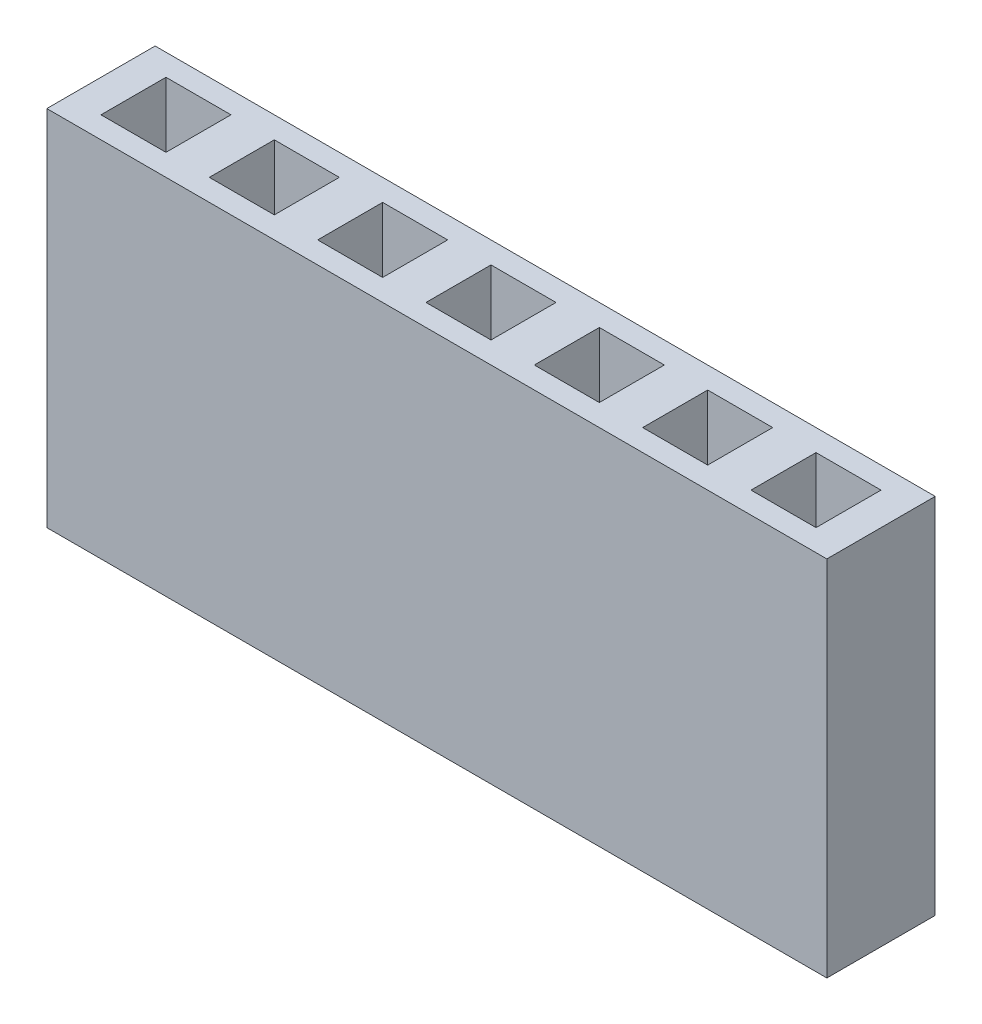
ISO-10303-21;
HEADER;
FILE_DESCRIPTION(('STEP AP214'),'2;1');
FILE_NAME('part.step','',(''),(''),'','','');
FILE_SCHEMA(('AUTOMOTIVE_DESIGN { 1 0 10303 214 1 1 1 1 }'));
ENDSEC;
DATA;
#1=APPLICATION_CONTEXT('core data for automotive mechanical design processes');
#2=APPLICATION_PROTOCOL_DEFINITION('international standard','automotive_design',2000,#1);
#3=PRODUCT_CONTEXT('',#1,'mechanical');
#4=PRODUCT('Part','Part','',(#3));
#5=PRODUCT_RELATED_PRODUCT_CATEGORY('part','',(#4));
#6=PRODUCT_DEFINITION_FORMATION('','',#4);
#7=PRODUCT_DEFINITION_CONTEXT('part definition',#1,'design');
#8=PRODUCT_DEFINITION('design','',#6,#7);
#9=PRODUCT_DEFINITION_SHAPE('','',#8);
#10=(LENGTH_UNIT() NAMED_UNIT(*) SI_UNIT(.MILLI.,.METRE.));
#11=(NAMED_UNIT(*) PLANE_ANGLE_UNIT() SI_UNIT($,.RADIAN.));
#12=(NAMED_UNIT(*) SI_UNIT($,.STERADIAN.) SOLID_ANGLE_UNIT());
#13=UNCERTAINTY_MEASURE_WITH_UNIT(LENGTH_MEASURE(1.E-05),#10,'distance_accuracy_value','');
#14=(GEOMETRIC_REPRESENTATION_CONTEXT(3) GLOBAL_UNCERTAINTY_ASSIGNED_CONTEXT((#13)) GLOBAL_UNIT_ASSIGNED_CONTEXT((#10,
#11,#12)) REPRESENTATION_CONTEXT('',''));
#15=CARTESIAN_POINT('',(0.,0.,0.));
#16=DIRECTION('',(0.,0.,1.));
#17=DIRECTION('',(1.,0.,0.));
#18=AXIS2_PLACEMENT_3D('',#15,#16,#17);
#19=CARTESIAN_POINT('',(-9.144,8.509,1.27));
#20=DIRECTION('',(1.,0.,0.));
#21=DIRECTION('',(0.,0.,-1.));
#22=AXIS2_PLACEMENT_3D('',#19,#20,#21);
#23=PLANE('',#22);
#24=DIRECTION('',(0.,0.,1.));
#25=VECTOR('',#24,1.);
#26=CARTESIAN_POINT('',(-9.144,0.,1.27));
#27=LINE('',#26,#25);
#28=CARTESIAN_POINT('',(-9.144,0.,-1.27));
#29=VERTEX_POINT('',#28);
#30=CARTESIAN_POINT('',(-9.144,0.,1.27));
#31=VERTEX_POINT('',#30);
#32=EDGE_CURVE('E466',#29,#31,#27,.T.);
#33=ORIENTED_EDGE('',*,*,#32,.T.);
#34=DIRECTION('',(0.,-1.,0.));
#35=VECTOR('',#34,1.);
#36=CARTESIAN_POINT('',(-9.144,8.509,1.27));
#37=LINE('',#36,#35);
#38=CARTESIAN_POINT('',(-9.144,8.509,1.27));
#39=VERTEX_POINT('',#38);
#40=EDGE_CURVE('E11',#39,#31,#37,.T.);
#41=ORIENTED_EDGE('',*,*,#40,.F.);
#42=DIRECTION('',(0.,0.,1.));
#43=VECTOR('',#42,1.);
#44=CARTESIAN_POINT('',(-9.144,8.509,1.27));
#45=LINE('',#44,#43);
#46=CARTESIAN_POINT('',(-9.144,8.509,-1.27));
#47=VERTEX_POINT('',#46);
#48=EDGE_CURVE('E473',#47,#39,#45,.T.);
#49=ORIENTED_EDGE('',*,*,#48,.F.);
#50=DIRECTION('',(0.,-1.,0.));
#51=VECTOR('',#50,1.);
#52=CARTESIAN_POINT('',(-9.144,8.509,-1.27));
#53=LINE('',#52,#51);
#54=EDGE_CURVE('E483',#47,#29,#53,.T.);
#55=ORIENTED_EDGE('',*,*,#54,.T.);
#56=EDGE_LOOP('',(#33,#41,#49,#55));
#57=FACE_BOUND('',#56,.T.);
#58=ADVANCED_FACE('F34',(#57),#23,.F.);
#59=CARTESIAN_POINT('',(9.144,8.509,1.27));
#60=DIRECTION('',(0.,0.,-1.));
#61=DIRECTION('',(-1.,0.,0.));
#62=AXIS2_PLACEMENT_3D('',#59,#60,#61);
#63=PLANE('',#62);
#64=DIRECTION('',(1.,0.,0.));
#65=VECTOR('',#64,1.);
#66=CARTESIAN_POINT('',(9.144,0.,1.27));
#67=LINE('',#66,#65);
#68=CARTESIAN_POINT('',(9.144,0.,1.27));
#69=VERTEX_POINT('',#68);
#70=EDGE_CURVE('E486',#31,#69,#67,.T.);
#71=ORIENTED_EDGE('',*,*,#70,.T.);
#72=DIRECTION('',(0.,-1.,0.));
#73=VECTOR('',#72,1.);
#74=CARTESIAN_POINT('',(9.144,8.509,1.27));
#75=LINE('',#74,#73);
#76=CARTESIAN_POINT('',(9.144,8.509,1.27));
#77=VERTEX_POINT('',#76);
#78=EDGE_CURVE('E41',#77,#69,#75,.T.);
#79=ORIENTED_EDGE('',*,*,#78,.F.);
#80=DIRECTION('',(1.,0.,0.));
#81=VECTOR('',#80,1.);
#82=CARTESIAN_POINT('',(9.144,8.509,1.27));
#83=LINE('',#82,#81);
#84=EDGE_CURVE('E476',#39,#77,#83,.T.);
#85=ORIENTED_EDGE('',*,*,#84,.F.);
#86=ORIENTED_EDGE('',*,*,#40,.T.);
#87=EDGE_LOOP('',(#71,#79,#85,#86));
#88=FACE_BOUND('',#87,.T.);
#89=ADVANCED_FACE('F516',(#88),#63,.F.);
#90=CARTESIAN_POINT('',(9.144,8.509,1.27));
#91=DIRECTION('',(-1.,0.,0.));
#92=DIRECTION('',(0.,0.,1.));
#93=AXIS2_PLACEMENT_3D('',#90,#91,#92);
#94=PLANE('',#93);
#95=DIRECTION('',(0.,0.,-1.));
#96=VECTOR('',#95,1.);
#97=CARTESIAN_POINT('',(9.144,0.,1.27));
#98=LINE('',#97,#96);
#99=CARTESIAN_POINT('',(9.144,0.,-1.27));
#100=VERTEX_POINT('',#99);
#101=EDGE_CURVE('E488',#69,#100,#98,.T.);
#102=ORIENTED_EDGE('',*,*,#101,.T.);
#103=DIRECTION('',(0.,-1.,0.));
#104=VECTOR('',#103,1.);
#105=CARTESIAN_POINT('',(9.144,8.509,-1.27));
#106=LINE('',#105,#104);
#107=CARTESIAN_POINT('',(9.144,8.509,-1.27));
#108=VERTEX_POINT('',#107);
#109=EDGE_CURVE('E493',#108,#100,#106,.T.);
#110=ORIENTED_EDGE('',*,*,#109,.F.);
#111=DIRECTION('',(0.,0.,-1.));
#112=VECTOR('',#111,1.);
#113=CARTESIAN_POINT('',(9.144,8.509,1.27));
#114=LINE('',#113,#112);
#115=EDGE_CURVE('E479',#77,#108,#114,.T.);
#116=ORIENTED_EDGE('',*,*,#115,.F.);
#117=ORIENTED_EDGE('',*,*,#78,.T.);
#118=EDGE_LOOP('',(#102,#110,#116,#117));
#119=FACE_BOUND('',#118,.T.);
#120=ADVANCED_FACE('F500',(#119),#94,.F.);
#121=CARTESIAN_POINT('',(9.144,8.509,-1.27));
#122=DIRECTION('',(0.,0.,1.));
#123=DIRECTION('',(1.,0.,0.));
#124=AXIS2_PLACEMENT_3D('',#121,#122,#123);
#125=PLANE('',#124);
#126=DIRECTION('',(-1.,0.,0.));
#127=VECTOR('',#126,1.);
#128=CARTESIAN_POINT('',(9.144,0.,-1.27));
#129=LINE('',#128,#127);
#130=EDGE_CURVE('E477',#100,#29,#129,.T.);
#131=ORIENTED_EDGE('',*,*,#130,.T.);
#132=ORIENTED_EDGE('',*,*,#54,.F.);
#133=DIRECTION('',(-1.,0.,0.));
#134=VECTOR('',#133,1.);
#135=CARTESIAN_POINT('',(9.144,8.509,-1.27));
#136=LINE('',#135,#134);
#137=EDGE_CURVE('E481',#108,#47,#136,.T.);
#138=ORIENTED_EDGE('',*,*,#137,.F.);
#139=ORIENTED_EDGE('',*,*,#109,.T.);
#140=EDGE_LOOP('',(#131,#132,#138,#139));
#141=FACE_BOUND('',#140,.T.);
#142=ADVANCED_FACE('F509',(#141),#125,.F.);
#143=CARTESIAN_POINT('',(0.,8.509,0.));
#144=DIRECTION('',(0.,1.,0.));
#145=DIRECTION('',(0.,0.,1.));
#146=AXIS2_PLACEMENT_3D('',#143,#144,#145);
#147=PLANE('',#146);
#148=DIRECTION('',(-1.,0.,0.));
#149=VECTOR('',#148,1.);
#150=CARTESIAN_POINT('',(-8.382,8.509,-0.761999999999947));
#151=LINE('',#150,#149);
#152=CARTESIAN_POINT('',(-6.858,8.509,-0.761999999999947));
#153=VERTEX_POINT('',#152);
#154=CARTESIAN_POINT('',(-8.382,8.509,-0.761999999999947));
#155=VERTEX_POINT('',#154);
#156=EDGE_CURVE('E48',#153,#155,#151,.T.);
#157=ORIENTED_EDGE('',*,*,#156,.F.);
#158=DIRECTION('',(0.,0.,-1.));
#159=VECTOR('',#158,1.);
#160=CARTESIAN_POINT('',(-6.858,8.509,0.762000000000053));
#161=LINE('',#160,#159);
#162=CARTESIAN_POINT('',(-6.858,8.509,0.762000000000053));
#163=VERTEX_POINT('',#162);
#164=EDGE_CURVE('E416',#163,#153,#161,.T.);
#165=ORIENTED_EDGE('',*,*,#164,.F.);
#166=DIRECTION('',(1.,0.,0.));
#167=VECTOR('',#166,1.);
#168=CARTESIAN_POINT('',(-8.382,8.509,0.762000000000053));
#169=LINE('',#168,#167);
#170=CARTESIAN_POINT('',(-8.382,8.509,0.762000000000053));
#171=VERTEX_POINT('',#170);
#172=EDGE_CURVE('E430',#171,#163,#169,.T.);
#173=ORIENTED_EDGE('',*,*,#172,.F.);
#174=DIRECTION('',(0.,0.,1.));
#175=VECTOR('',#174,1.);
#176=CARTESIAN_POINT('',(-8.382,8.509,0.762000000000053));
#177=LINE('',#176,#175);
#178=EDGE_CURVE('E427',#155,#171,#177,.T.);
#179=ORIENTED_EDGE('',*,*,#178,.F.);
#180=EDGE_LOOP('',(#157,#165,#173,#179));
#181=FACE_BOUND('',#180,.T.);
#182=DIRECTION('',(-1.,0.,0.));
#183=VECTOR('',#182,1.);
#184=CARTESIAN_POINT('',(-5.842,8.509,-0.761999999999964));
#185=LINE('',#184,#183);
#186=CARTESIAN_POINT('',(-4.318,8.509,-0.761999999999964));
#187=VERTEX_POINT('',#186);
#188=CARTESIAN_POINT('',(-5.842,8.509,-0.761999999999964));
#189=VERTEX_POINT('',#188);
#190=EDGE_CURVE('E56',#187,#189,#185,.T.);
#191=ORIENTED_EDGE('',*,*,#190,.F.);
#192=DIRECTION('',(0.,0.,-1.));
#193=VECTOR('',#192,1.);
#194=CARTESIAN_POINT('',(-4.318,8.509,0.762000000000035));
#195=LINE('',#194,#193);
#196=CARTESIAN_POINT('',(-4.318,8.509,0.762000000000035));
#197=VERTEX_POINT('',#196);
#198=EDGE_CURVE('E386',#197,#187,#195,.T.);
#199=ORIENTED_EDGE('',*,*,#198,.F.);
#200=DIRECTION('',(1.,0.,0.));
#201=VECTOR('',#200,1.);
#202=CARTESIAN_POINT('',(-5.842,8.509,0.762000000000035));
#203=LINE('',#202,#201);
#204=CARTESIAN_POINT('',(-5.842,8.509,0.762000000000035));
#205=VERTEX_POINT('',#204);
#206=EDGE_CURVE('E401',#205,#197,#203,.T.);
#207=ORIENTED_EDGE('',*,*,#206,.F.);
#208=DIRECTION('',(0.,0.,1.));
#209=VECTOR('',#208,1.);
#210=CARTESIAN_POINT('',(-5.842,8.509,0.762000000000035));
#211=LINE('',#210,#209);
#212=EDGE_CURVE('E397',#189,#205,#211,.T.);
#213=ORIENTED_EDGE('',*,*,#212,.F.);
#214=EDGE_LOOP('',(#191,#199,#207,#213));
#215=FACE_BOUND('',#214,.T.);
#216=DIRECTION('',(-1.,0.,0.));
#217=VECTOR('',#216,1.);
#218=CARTESIAN_POINT('',(1.778,8.509,-0.762));
#219=LINE('',#218,#217);
#220=CARTESIAN_POINT('',(3.302,8.509,-0.762));
#221=VERTEX_POINT('',#220);
#222=CARTESIAN_POINT('',(1.778,8.509,-0.762));
#223=VERTEX_POINT('',#222);
#224=EDGE_CURVE('E332',#221,#223,#219,.T.);
#225=ORIENTED_EDGE('',*,*,#224,.F.);
#226=DIRECTION('',(0.,0.,-1.));
#227=VECTOR('',#226,1.);
#228=CARTESIAN_POINT('',(3.302,8.509,0.762));
#229=LINE('',#228,#227);
#230=CARTESIAN_POINT('',(3.302,8.509,0.762));
#231=VERTEX_POINT('',#230);
#232=EDGE_CURVE('E322',#231,#221,#229,.T.);
#233=ORIENTED_EDGE('',*,*,#232,.F.);
#234=DIRECTION('',(1.,0.,0.));
#235=VECTOR('',#234,1.);
#236=CARTESIAN_POINT('',(1.778,8.509,0.762));
#237=LINE('',#236,#235);
#238=CARTESIAN_POINT('',(1.778,8.509,0.762));
#239=VERTEX_POINT('',#238);
#240=EDGE_CURVE('E338',#239,#231,#237,.T.);
#241=ORIENTED_EDGE('',*,*,#240,.F.);
#242=DIRECTION('',(0.,0.,1.));
#243=VECTOR('',#242,1.);
#244=CARTESIAN_POINT('',(1.778,8.509,0.762));
#245=LINE('',#244,#243);
#246=EDGE_CURVE('E334',#223,#239,#245,.T.);
#247=ORIENTED_EDGE('',*,*,#246,.F.);
#248=EDGE_LOOP('',(#225,#233,#241,#247));
#249=FACE_BOUND('',#248,.T.);
#250=DIRECTION('',(-1.,0.,0.));
#251=VECTOR('',#250,1.);
#252=CARTESIAN_POINT('',(4.318,8.509,-0.762));
#253=LINE('',#252,#251);
#254=CARTESIAN_POINT('',(5.842,8.509,-0.762));
#255=VERTEX_POINT('',#254);
#256=CARTESIAN_POINT('',(4.318,8.509,-0.762));
#257=VERTEX_POINT('',#256);
#258=EDGE_CURVE('E282',#255,#257,#253,.T.);
#259=ORIENTED_EDGE('',*,*,#258,.F.);
#260=DIRECTION('',(0.,0.,-1.));
#261=VECTOR('',#260,1.);
#262=CARTESIAN_POINT('',(5.842,8.509,0.762));
#263=LINE('',#262,#261);
#264=CARTESIAN_POINT('',(5.842,8.509,0.762));
#265=VERTEX_POINT('',#264);
#266=EDGE_CURVE('E356',#265,#255,#263,.T.);
#267=ORIENTED_EDGE('',*,*,#266,.F.);
#268=DIRECTION('',(1.,0.,0.));
#269=VECTOR('',#268,1.);
#270=CARTESIAN_POINT('',(4.318,8.509,0.762));
#271=LINE('',#270,#269);
#272=CARTESIAN_POINT('',(4.318,8.509,0.762));
#273=VERTEX_POINT('',#272);
#274=EDGE_CURVE('E370',#273,#265,#271,.T.);
#275=ORIENTED_EDGE('',*,*,#274,.F.);
#276=DIRECTION('',(0.,0.,1.));
#277=VECTOR('',#276,1.);
#278=CARTESIAN_POINT('',(4.318,8.509,0.762));
#279=LINE('',#278,#277);
#280=EDGE_CURVE('E367',#257,#273,#279,.T.);
#281=ORIENTED_EDGE('',*,*,#280,.F.);
#282=EDGE_LOOP('',(#259,#267,#275,#281));
#283=FACE_BOUND('',#282,.T.);
#284=DIRECTION('',(-1.,0.,0.));
#285=VECTOR('',#284,1.);
#286=CARTESIAN_POINT('',(6.858,8.509,-0.762));
#287=LINE('',#286,#285);
#288=CARTESIAN_POINT('',(8.382,8.509,-0.762));
#289=VERTEX_POINT('',#288);
#290=CARTESIAN_POINT('',(6.858,8.509,-0.762));
#291=VERTEX_POINT('',#290);
#292=EDGE_CURVE('E249',#289,#291,#287,.T.);
#293=ORIENTED_EDGE('',*,*,#292,.F.);
#294=DIRECTION('',(0.,0.,-1.));
#295=VECTOR('',#294,1.);
#296=CARTESIAN_POINT('',(8.382,8.509,0.762));
#297=LINE('',#296,#295);
#298=CARTESIAN_POINT('',(8.382,8.509,0.762));
#299=VERTEX_POINT('',#298);
#300=EDGE_CURVE('E266',#299,#289,#297,.T.);
#301=ORIENTED_EDGE('',*,*,#300,.F.);
#302=DIRECTION('',(1.,0.,0.));
#303=VECTOR('',#302,1.);
#304=CARTESIAN_POINT('',(6.858,8.509,0.762));
#305=LINE('',#304,#303);
#306=CARTESIAN_POINT('',(6.858,8.509,0.762));
#307=VERTEX_POINT('',#306);
#308=EDGE_CURVE('E269',#307,#299,#305,.T.);
#309=ORIENTED_EDGE('',*,*,#308,.F.);
#310=DIRECTION('',(0.,0.,1.));
#311=VECTOR('',#310,1.);
#312=CARTESIAN_POINT('',(6.858,8.509,0.762));
#313=LINE('',#312,#311);
#314=EDGE_CURVE('E275',#291,#307,#313,.T.);
#315=ORIENTED_EDGE('',*,*,#314,.F.);
#316=EDGE_LOOP('',(#293,#301,#309,#315));
#317=FACE_BOUND('',#316,.T.);
#318=DIRECTION('',(-1.,0.,0.));
#319=VECTOR('',#318,1.);
#320=CARTESIAN_POINT('',(-3.302,8.509,-0.761999999999982));
#321=LINE('',#320,#319);
#322=CARTESIAN_POINT('',(-1.778,8.509,-0.761999999999982));
#323=VERTEX_POINT('',#322);
#324=CARTESIAN_POINT('',(-3.302,8.509,-0.761999999999982));
#325=VERTEX_POINT('',#324);
#326=EDGE_CURVE('E300',#323,#325,#321,.T.);
#327=ORIENTED_EDGE('',*,*,#326,.F.);
#328=DIRECTION('',(0.,0.,-1.));
#329=VECTOR('',#328,1.);
#330=CARTESIAN_POINT('',(-1.778,8.509,0.762000000000018));
#331=LINE('',#330,#329);
#332=CARTESIAN_POINT('',(-1.778,8.509,0.762000000000018));
#333=VERTEX_POINT('',#332);
#334=EDGE_CURVE('E290',#333,#323,#331,.T.);
#335=ORIENTED_EDGE('',*,*,#334,.F.);
#336=DIRECTION('',(1.,0.,0.));
#337=VECTOR('',#336,1.);
#338=CARTESIAN_POINT('',(-3.302,8.509,0.762000000000018));
#339=LINE('',#338,#337);
#340=CARTESIAN_POINT('',(-3.302,8.509,0.762000000000018));
#341=VERTEX_POINT('',#340);
#342=EDGE_CURVE('E306',#341,#333,#339,.T.);
#343=ORIENTED_EDGE('',*,*,#342,.F.);
#344=DIRECTION('',(0.,0.,1.));
#345=VECTOR('',#344,1.);
#346=CARTESIAN_POINT('',(-3.302,8.509,0.762000000000018));
#347=LINE('',#346,#345);
#348=EDGE_CURVE('E302',#325,#341,#347,.T.);
#349=ORIENTED_EDGE('',*,*,#348,.F.);
#350=EDGE_LOOP('',(#327,#335,#343,#349));
#351=FACE_BOUND('',#350,.T.);
#352=DIRECTION('',(0.,0.,-1.));
#353=VECTOR('',#352,1.);
#354=CARTESIAN_POINT('',(0.762,8.509,0.762));
#355=LINE('',#354,#353);
#356=CARTESIAN_POINT('',(0.762,8.509,0.762));
#357=VERTEX_POINT('',#356);
#358=CARTESIAN_POINT('',(0.762,8.509,-0.762));
#359=VERTEX_POINT('',#358);
#360=EDGE_CURVE('E345',#357,#359,#355,.T.);
#361=ORIENTED_EDGE('',*,*,#360,.F.);
#362=DIRECTION('',(1.,0.,0.));
#363=VECTOR('',#362,1.);
#364=CARTESIAN_POINT('',(-0.762,8.509,0.762));
#365=LINE('',#364,#363);
#366=CARTESIAN_POINT('',(-0.762,8.509,0.762));
#367=VERTEX_POINT('',#366);
#368=EDGE_CURVE('E445',#367,#357,#365,.T.);
#369=ORIENTED_EDGE('',*,*,#368,.F.);
#370=DIRECTION('',(0.,0.,1.));
#371=VECTOR('',#370,1.);
#372=CARTESIAN_POINT('',(-0.762,8.509,0.762));
#373=LINE('',#372,#371);
#374=CARTESIAN_POINT('',(-0.762,8.509,-0.762));
#375=VERTEX_POINT('',#374);
#376=EDGE_CURVE('E459',#375,#367,#373,.T.);
#377=ORIENTED_EDGE('',*,*,#376,.F.);
#378=DIRECTION('',(-1.,0.,0.));
#379=VECTOR('',#378,1.);
#380=CARTESIAN_POINT('',(-0.762,8.509,-0.762));
#381=LINE('',#380,#379);
#382=EDGE_CURVE('E456',#359,#375,#381,.T.);
#383=ORIENTED_EDGE('',*,*,#382,.F.);
#384=EDGE_LOOP('',(#361,#369,#377,#383));
#385=FACE_BOUND('',#384,.T.);
#386=ORIENTED_EDGE('',*,*,#48,.T.);
#387=ORIENTED_EDGE('',*,*,#84,.T.);
#388=ORIENTED_EDGE('',*,*,#115,.T.);
#389=ORIENTED_EDGE('',*,*,#137,.T.);
#390=EDGE_LOOP('',(#386,#387,#388,#389));
#391=FACE_BOUND('',#390,.T.);
#392=ADVANCED_FACE('F515',(#181,#215,#249,#283,#317,#351,#385,#391),#147,.T.);
#393=CARTESIAN_POINT('',(0.,0.,0.));
#394=DIRECTION('',(0.,1.,0.));
#395=DIRECTION('',(0.,0.,1.));
#396=AXIS2_PLACEMENT_3D('',#393,#394,#395);
#397=PLANE('',#396);
#398=ORIENTED_EDGE('',*,*,#32,.F.);
#399=ORIENTED_EDGE('',*,*,#130,.F.);
#400=ORIENTED_EDGE('',*,*,#101,.F.);
#401=ORIENTED_EDGE('',*,*,#70,.F.);
#402=EDGE_LOOP('',(#398,#399,#400,#401));
#403=FACE_BOUND('',#402,.T.);
#404=ADVANCED_FACE('F506',(#403),#397,.F.);
#405=CARTESIAN_POINT('',(0.762,2.5146,0.762));
#406=DIRECTION('',(1.,0.,0.));
#407=DIRECTION('',(0.,0.,-1.));
#408=AXIS2_PLACEMENT_3D('',#405,#406,#407);
#409=PLANE('',#408);
#410=ORIENTED_EDGE('',*,*,#360,.T.);
#411=DIRECTION('',(0.,1.,0.));
#412=VECTOR('',#411,1.);
#413=CARTESIAN_POINT('',(0.762,2.5146,-0.762));
#414=LINE('',#413,#412);
#415=CARTESIAN_POINT('',(0.762,2.5146,-0.762));
#416=VERTEX_POINT('',#415);
#417=EDGE_CURVE('E454',#416,#359,#414,.T.);
#418=ORIENTED_EDGE('',*,*,#417,.F.);
#419=DIRECTION('',(0.,0.,-1.));
#420=VECTOR('',#419,1.);
#421=CARTESIAN_POINT('',(0.762,2.5146,0.762));
#422=LINE('',#421,#420);
#423=CARTESIAN_POINT('',(0.762,2.5146,0.762));
#424=VERTEX_POINT('',#423);
#425=EDGE_CURVE('E441',#424,#416,#422,.T.);
#426=ORIENTED_EDGE('',*,*,#425,.F.);
#427=DIRECTION('',(0.,1.,0.));
#428=VECTOR('',#427,1.);
#429=CARTESIAN_POINT('',(0.762,2.5146,0.762));
#430=LINE('',#429,#428);
#431=EDGE_CURVE('E464',#424,#357,#430,.T.);
#432=ORIENTED_EDGE('',*,*,#431,.T.);
#433=EDGE_LOOP('',(#410,#418,#426,#432));
#434=FACE_BOUND('',#433,.T.);
#435=ADVANCED_FACE('F528',(#434),#409,.F.);
#436=CARTESIAN_POINT('',(-0.762,2.5146,0.762));
#437=DIRECTION('',(0.,0.,1.));
#438=DIRECTION('',(1.,0.,0.));
#439=AXIS2_PLACEMENT_3D('',#436,#437,#438);
#440=PLANE('',#439);
#441=ORIENTED_EDGE('',*,*,#368,.T.);
#442=ORIENTED_EDGE('',*,*,#431,.F.);
#443=DIRECTION('',(1.,0.,0.));
#444=VECTOR('',#443,1.);
#445=CARTESIAN_POINT('',(-0.762,2.5146,0.762));
#446=LINE('',#445,#444);
#447=CARTESIAN_POINT('',(-0.762,2.5146,0.762));
#448=VERTEX_POINT('',#447);
#449=EDGE_CURVE('E451',#448,#424,#446,.T.);
#450=ORIENTED_EDGE('',*,*,#449,.F.);
#451=DIRECTION('',(0.,1.,0.));
#452=VECTOR('',#451,1.);
#453=CARTESIAN_POINT('',(-0.762,2.5146,0.762));
#454=LINE('',#453,#452);
#455=EDGE_CURVE('E467',#448,#367,#454,.T.);
#456=ORIENTED_EDGE('',*,*,#455,.T.);
#457=EDGE_LOOP('',(#441,#442,#450,#456));
#458=FACE_BOUND('',#457,.T.);
#459=ADVANCED_FACE('F534',(#458),#440,.F.);
#460=CARTESIAN_POINT('',(-0.762,2.5146,0.762));
#461=DIRECTION('',(-1.,0.,0.));
#462=DIRECTION('',(0.,0.,1.));
#463=AXIS2_PLACEMENT_3D('',#460,#461,#462);
#464=PLANE('',#463);
#465=ORIENTED_EDGE('',*,*,#376,.T.);
#466=ORIENTED_EDGE('',*,*,#455,.F.);
#467=DIRECTION('',(0.,0.,1.));
#468=VECTOR('',#467,1.);
#469=CARTESIAN_POINT('',(-0.762,2.5146,0.762));
#470=LINE('',#469,#468);
#471=CARTESIAN_POINT('',(-0.762,2.5146,-0.762));
#472=VERTEX_POINT('',#471);
#473=EDGE_CURVE('E448',#472,#448,#470,.T.);
#474=ORIENTED_EDGE('',*,*,#473,.F.);
#475=DIRECTION('',(0.,1.,0.));
#476=VECTOR('',#475,1.);
#477=CARTESIAN_POINT('',(-0.762,2.5146,-0.762));
#478=LINE('',#477,#476);
#479=EDGE_CURVE('E469',#472,#375,#478,.T.);
#480=ORIENTED_EDGE('',*,*,#479,.T.);
#481=EDGE_LOOP('',(#465,#466,#474,#480));
#482=FACE_BOUND('',#481,.T.);
#483=ADVANCED_FACE('F540',(#482),#464,.F.);
#484=CARTESIAN_POINT('',(-0.762,2.5146,-0.762));
#485=DIRECTION('',(0.,0.,-1.));
#486=DIRECTION('',(-1.,0.,0.));
#487=AXIS2_PLACEMENT_3D('',#484,#485,#486);
#488=PLANE('',#487);
#489=ORIENTED_EDGE('',*,*,#382,.T.);
#490=ORIENTED_EDGE('',*,*,#479,.F.);
#491=DIRECTION('',(-1.,0.,0.));
#492=VECTOR('',#491,1.);
#493=CARTESIAN_POINT('',(-0.762,2.5146,-0.762));
#494=LINE('',#493,#492);
#495=EDGE_CURVE('E444',#416,#472,#494,.T.);
#496=ORIENTED_EDGE('',*,*,#495,.F.);
#497=ORIENTED_EDGE('',*,*,#417,.T.);
#498=EDGE_LOOP('',(#489,#490,#496,#497));
#499=FACE_BOUND('',#498,.T.);
#500=ADVANCED_FACE('F536',(#499),#488,.F.);
#501=CARTESIAN_POINT('',(0.,2.5146,0.));
#502=DIRECTION('',(0.,-1.,0.));
#503=DIRECTION('',(0.,0.,-1.));
#504=AXIS2_PLACEMENT_3D('',#501,#502,#503);
#505=PLANE('',#504);
#506=ORIENTED_EDGE('',*,*,#425,.T.);
#507=ORIENTED_EDGE('',*,*,#495,.T.);
#508=ORIENTED_EDGE('',*,*,#473,.T.);
#509=ORIENTED_EDGE('',*,*,#449,.T.);
#510=EDGE_LOOP('',(#506,#507,#508,#509));
#511=FACE_BOUND('',#510,.T.);
#512=ADVANCED_FACE('F539',(#511),#505,.F.);
#513=CARTESIAN_POINT('',(-3.302,2.5146,-0.761999999999982));
#514=DIRECTION('',(0.,0.,-1.));
#515=DIRECTION('',(-1.,0.,0.));
#516=AXIS2_PLACEMENT_3D('',#513,#514,#515);
#517=PLANE('',#516);
#518=ORIENTED_EDGE('',*,*,#326,.T.);
#519=DIRECTION('',(0.,1.,0.));
#520=VECTOR('',#519,1.);
#521=CARTESIAN_POINT('',(-3.302,2.5146,-0.761999999999982));
#522=LINE('',#521,#520);
#523=CARTESIAN_POINT('',(-3.302,2.5146,-0.761999999999982));
#524=VERTEX_POINT('',#523);
#525=EDGE_CURVE('E299',#524,#325,#522,.T.);
#526=ORIENTED_EDGE('',*,*,#525,.F.);
#527=DIRECTION('',(-1.,0.,0.));
#528=VECTOR('',#527,1.);
#529=CARTESIAN_POINT('',(-3.302,2.5146,-0.761999999999982));
#530=LINE('',#529,#528);
#531=CARTESIAN_POINT('',(-1.778,2.5146,-0.761999999999982));
#532=VERTEX_POINT('',#531);
#533=EDGE_CURVE('E286',#532,#524,#530,.T.);
#534=ORIENTED_EDGE('',*,*,#533,.F.);
#535=DIRECTION('',(0.,1.,0.));
#536=VECTOR('',#535,1.);
#537=CARTESIAN_POINT('',(-1.778,2.5146,-0.761999999999982));
#538=LINE('',#537,#536);
#539=EDGE_CURVE('E276',#532,#323,#538,.T.);
#540=ORIENTED_EDGE('',*,*,#539,.T.);
#541=EDGE_LOOP('',(#518,#526,#534,#540));
#542=FACE_BOUND('',#541,.T.);
#543=ADVANCED_FACE('F550',(#542),#517,.F.);
#544=CARTESIAN_POINT('',(-1.778,2.5146,0.762000000000018));
#545=DIRECTION('',(1.,0.,0.));
#546=DIRECTION('',(0.,0.,-1.));
#547=AXIS2_PLACEMENT_3D('',#544,#545,#546);
#548=PLANE('',#547);
#549=ORIENTED_EDGE('',*,*,#334,.T.);
#550=ORIENTED_EDGE('',*,*,#539,.F.);
#551=DIRECTION('',(0.,0.,-1.));
#552=VECTOR('',#551,1.);
#553=CARTESIAN_POINT('',(-1.778,2.5146,0.762000000000018));
#554=LINE('',#553,#552);
#555=CARTESIAN_POINT('',(-1.778,2.5146,0.762000000000018));
#556=VERTEX_POINT('',#555);
#557=EDGE_CURVE('E296',#556,#532,#554,.T.);
#558=ORIENTED_EDGE('',*,*,#557,.F.);
#559=DIRECTION('',(0.,1.,0.));
#560=VECTOR('',#559,1.);
#561=CARTESIAN_POINT('',(-1.778,2.5146,0.762000000000018));
#562=LINE('',#561,#560);
#563=EDGE_CURVE('E312',#556,#333,#562,.T.);
#564=ORIENTED_EDGE('',*,*,#563,.T.);
#565=EDGE_LOOP('',(#549,#550,#558,#564));
#566=FACE_BOUND('',#565,.T.);
#567=ADVANCED_FACE('F632',(#566),#548,.F.);
#568=CARTESIAN_POINT('',(-3.302,2.5146,0.762000000000018));
#569=DIRECTION('',(0.,0.,1.));
#570=DIRECTION('',(1.,0.,0.));
#571=AXIS2_PLACEMENT_3D('',#568,#569,#570);
#572=PLANE('',#571);
#573=ORIENTED_EDGE('',*,*,#342,.T.);
#574=ORIENTED_EDGE('',*,*,#563,.F.);
#575=DIRECTION('',(1.,0.,0.));
#576=VECTOR('',#575,1.);
#577=CARTESIAN_POINT('',(-3.302,2.5146,0.762000000000018));
#578=LINE('',#577,#576);
#579=CARTESIAN_POINT('',(-3.302,2.5146,0.762000000000018));
#580=VERTEX_POINT('',#579);
#581=EDGE_CURVE('E293',#580,#556,#578,.T.);
#582=ORIENTED_EDGE('',*,*,#581,.F.);
#583=DIRECTION('',(0.,1.,0.));
#584=VECTOR('',#583,1.);
#585=CARTESIAN_POINT('',(-3.302,2.5146,0.762000000000018));
#586=LINE('',#585,#584);
#587=EDGE_CURVE('E314',#580,#341,#586,.T.);
#588=ORIENTED_EDGE('',*,*,#587,.T.);
#589=EDGE_LOOP('',(#573,#574,#582,#588));
#590=FACE_BOUND('',#589,.T.);
#591=ADVANCED_FACE('F638',(#590),#572,.F.);
#592=CARTESIAN_POINT('',(-3.302,2.5146,0.762000000000018));
#593=DIRECTION('',(-1.,0.,0.));
#594=DIRECTION('',(0.,0.,1.));
#595=AXIS2_PLACEMENT_3D('',#592,#593,#594);
#596=PLANE('',#595);
#597=ORIENTED_EDGE('',*,*,#348,.T.);
#598=ORIENTED_EDGE('',*,*,#587,.F.);
#599=DIRECTION('',(0.,0.,1.));
#600=VECTOR('',#599,1.);
#601=CARTESIAN_POINT('',(-3.302,2.5146,0.762000000000018));
#602=LINE('',#601,#600);
#603=EDGE_CURVE('E289',#524,#580,#602,.T.);
#604=ORIENTED_EDGE('',*,*,#603,.F.);
#605=ORIENTED_EDGE('',*,*,#525,.T.);
#606=EDGE_LOOP('',(#597,#598,#604,#605));
#607=FACE_BOUND('',#606,.T.);
#608=ADVANCED_FACE('F634',(#607),#596,.F.);
#609=CARTESIAN_POINT('',(0.,2.5146,0.));
#610=DIRECTION('',(0.,1.,0.));
#611=DIRECTION('',(0.,0.,1.));
#612=AXIS2_PLACEMENT_3D('',#609,#610,#611);
#613=PLANE('',#612);
#614=ORIENTED_EDGE('',*,*,#533,.T.);
#615=ORIENTED_EDGE('',*,*,#603,.T.);
#616=ORIENTED_EDGE('',*,*,#581,.T.);
#617=ORIENTED_EDGE('',*,*,#557,.T.);
#618=EDGE_LOOP('',(#614,#615,#616,#617));
#619=FACE_BOUND('',#618,.T.);
#620=ADVANCED_FACE('F637',(#619),#613,.T.);
#621=CARTESIAN_POINT('',(6.858,2.5146,-0.762));
#622=DIRECTION('',(0.,0.,-1.));
#623=DIRECTION('',(-1.,0.,0.));
#624=AXIS2_PLACEMENT_3D('',#621,#622,#623);
#625=PLANE('',#624);
#626=ORIENTED_EDGE('',*,*,#292,.T.);
#627=DIRECTION('',(0.,1.,0.));
#628=VECTOR('',#627,1.);
#629=CARTESIAN_POINT('',(6.858,2.5146,-0.762));
#630=LINE('',#629,#628);
#631=CARTESIAN_POINT('',(6.858,2.5146,-0.762));
#632=VERTEX_POINT('',#631);
#633=EDGE_CURVE('E242',#632,#291,#630,.T.);
#634=ORIENTED_EDGE('',*,*,#633,.F.);
#635=DIRECTION('',(-1.,0.,0.));
#636=VECTOR('',#635,1.);
#637=CARTESIAN_POINT('',(6.858,2.5146,-0.762));
#638=LINE('',#637,#636);
#639=CARTESIAN_POINT('',(8.382,2.5146,-0.762));
#640=VERTEX_POINT('',#639);
#641=EDGE_CURVE('E246',#640,#632,#638,.T.);
#642=ORIENTED_EDGE('',*,*,#641,.F.);
#643=DIRECTION('',(0.,1.,0.));
#644=VECTOR('',#643,1.);
#645=CARTESIAN_POINT('',(8.382,2.5146,-0.762));
#646=LINE('',#645,#644);
#647=EDGE_CURVE('E280',#640,#289,#646,.T.);
#648=ORIENTED_EDGE('',*,*,#647,.T.);
#649=EDGE_LOOP('',(#626,#634,#642,#648));
#650=FACE_BOUND('',#649,.T.);
#651=ADVANCED_FACE('F244',(#650),#625,.F.);
#652=CARTESIAN_POINT('',(8.382,2.5146,0.762));
#653=DIRECTION('',(1.,0.,0.));
#654=DIRECTION('',(0.,0.,-1.));
#655=AXIS2_PLACEMENT_3D('',#652,#653,#654);
#656=PLANE('',#655);
#657=ORIENTED_EDGE('',*,*,#300,.T.);
#658=ORIENTED_EDGE('',*,*,#647,.F.);
#659=DIRECTION('',(0.,0.,-1.));
#660=VECTOR('',#659,1.);
#661=CARTESIAN_POINT('',(8.382,2.5146,0.762));
#662=LINE('',#661,#660);
#663=CARTESIAN_POINT('',(8.382,2.5146,0.762));
#664=VERTEX_POINT('',#663);
#665=EDGE_CURVE('E254',#664,#640,#662,.T.);
#666=ORIENTED_EDGE('',*,*,#665,.F.);
#667=DIRECTION('',(0.,1.,0.));
#668=VECTOR('',#667,1.);
#669=CARTESIAN_POINT('',(8.382,2.5146,0.762));
#670=LINE('',#669,#668);
#671=EDGE_CURVE('E283',#664,#299,#670,.T.);
#672=ORIENTED_EDGE('',*,*,#671,.T.);
#673=EDGE_LOOP('',(#657,#658,#666,#672));
#674=FACE_BOUND('',#673,.T.);
#675=ADVANCED_FACE('F651',(#674),#656,.F.);
#676=CARTESIAN_POINT('',(6.858,2.5146,0.762));
#677=DIRECTION('',(0.,0.,1.));
#678=DIRECTION('',(1.,0.,0.));
#679=AXIS2_PLACEMENT_3D('',#676,#677,#678);
#680=PLANE('',#679);
#681=ORIENTED_EDGE('',*,*,#308,.T.);
#682=ORIENTED_EDGE('',*,*,#671,.F.);
#683=DIRECTION('',(1.,0.,0.));
#684=VECTOR('',#683,1.);
#685=CARTESIAN_POINT('',(6.858,2.5146,0.762));
#686=LINE('',#685,#684);
#687=CARTESIAN_POINT('',(6.858,2.5146,0.762));
#688=VERTEX_POINT('',#687);
#689=EDGE_CURVE('E262',#688,#664,#686,.T.);
#690=ORIENTED_EDGE('',*,*,#689,.F.);
#691=DIRECTION('',(0.,1.,0.));
#692=VECTOR('',#691,1.);
#693=CARTESIAN_POINT('',(6.858,2.5146,0.762));
#694=LINE('',#693,#692);
#695=EDGE_CURVE('E253',#688,#307,#694,.T.);
#696=ORIENTED_EDGE('',*,*,#695,.T.);
#697=EDGE_LOOP('',(#681,#682,#690,#696));
#698=FACE_BOUND('',#697,.T.);
#699=ADVANCED_FACE('F654',(#698),#680,.F.);
#700=CARTESIAN_POINT('',(6.858,2.5146,0.762));
#701=DIRECTION('',(-1.,0.,0.));
#702=DIRECTION('',(0.,0.,1.));
#703=AXIS2_PLACEMENT_3D('',#700,#701,#702);
#704=PLANE('',#703);
#705=ORIENTED_EDGE('',*,*,#314,.T.);
#706=ORIENTED_EDGE('',*,*,#695,.F.);
#707=DIRECTION('',(0.,0.,1.));
#708=VECTOR('',#707,1.);
#709=CARTESIAN_POINT('',(6.858,2.5146,0.762));
#710=LINE('',#709,#708);
#711=EDGE_CURVE('E257',#632,#688,#710,.T.);
#712=ORIENTED_EDGE('',*,*,#711,.F.);
#713=ORIENTED_EDGE('',*,*,#633,.T.);
#714=EDGE_LOOP('',(#705,#706,#712,#713));
#715=FACE_BOUND('',#714,.T.);
#716=ADVANCED_FACE('F258',(#715),#704,.F.);
#717=CARTESIAN_POINT('',(0.,2.5146,0.));
#718=DIRECTION('',(0.,1.,0.));
#719=DIRECTION('',(0.,0.,1.));
#720=AXIS2_PLACEMENT_3D('',#717,#718,#719);
#721=PLANE('',#720);
#722=ORIENTED_EDGE('',*,*,#641,.T.);
#723=ORIENTED_EDGE('',*,*,#711,.T.);
#724=ORIENTED_EDGE('',*,*,#689,.T.);
#725=ORIENTED_EDGE('',*,*,#665,.T.);
#726=EDGE_LOOP('',(#722,#723,#724,#725));
#727=FACE_BOUND('',#726,.T.);
#728=ADVANCED_FACE('F264',(#727),#721,.T.);
#729=CARTESIAN_POINT('',(4.318,2.5146,-0.762));
#730=DIRECTION('',(0.,0.,-1.));
#731=DIRECTION('',(-1.,0.,0.));
#732=AXIS2_PLACEMENT_3D('',#729,#730,#731);
#733=PLANE('',#732);
#734=ORIENTED_EDGE('',*,*,#258,.T.);
#735=DIRECTION('',(0.,1.,0.));
#736=VECTOR('',#735,1.);
#737=CARTESIAN_POINT('',(4.318,2.5146,-0.762));
#738=LINE('',#737,#736);
#739=CARTESIAN_POINT('',(4.318,2.5146,-0.762));
#740=VERTEX_POINT('',#739);
#741=EDGE_CURVE('E365',#740,#257,#738,.T.);
#742=ORIENTED_EDGE('',*,*,#741,.F.);
#743=DIRECTION('',(-1.,0.,0.));
#744=VECTOR('',#743,1.);
#745=CARTESIAN_POINT('',(4.318,2.5146,-0.762));
#746=LINE('',#745,#744);
#747=CARTESIAN_POINT('',(5.842,2.5146,-0.762));
#748=VERTEX_POINT('',#747);
#749=EDGE_CURVE('E352',#748,#740,#746,.T.);
#750=ORIENTED_EDGE('',*,*,#749,.F.);
#751=DIRECTION('',(0.,1.,0.));
#752=VECTOR('',#751,1.);
#753=CARTESIAN_POINT('',(5.842,2.5146,-0.762));
#754=LINE('',#753,#752);
#755=EDGE_CURVE('E335',#748,#255,#754,.T.);
#756=ORIENTED_EDGE('',*,*,#755,.T.);
#757=EDGE_LOOP('',(#734,#742,#750,#756));
#758=FACE_BOUND('',#757,.T.);
#759=ADVANCED_FACE('F591',(#758),#733,.F.);
#760=CARTESIAN_POINT('',(5.842,2.5146,0.762));
#761=DIRECTION('',(1.,0.,0.));
#762=DIRECTION('',(0.,0.,-1.));
#763=AXIS2_PLACEMENT_3D('',#760,#761,#762);
#764=PLANE('',#763);
#765=ORIENTED_EDGE('',*,*,#266,.T.);
#766=ORIENTED_EDGE('',*,*,#755,.F.);
#767=DIRECTION('',(0.,0.,-1.));
#768=VECTOR('',#767,1.);
#769=CARTESIAN_POINT('',(5.842,2.5146,0.762));
#770=LINE('',#769,#768);
#771=CARTESIAN_POINT('',(5.842,2.5146,0.762));
#772=VERTEX_POINT('',#771);
#773=EDGE_CURVE('E362',#772,#748,#770,.T.);
#774=ORIENTED_EDGE('',*,*,#773,.F.);
#775=DIRECTION('',(0.,1.,0.));
#776=VECTOR('',#775,1.);
#777=CARTESIAN_POINT('',(5.842,2.5146,0.762));
#778=LINE('',#777,#776);
#779=EDGE_CURVE('E376',#772,#265,#778,.T.);
#780=ORIENTED_EDGE('',*,*,#779,.T.);
#781=EDGE_LOOP('',(#765,#766,#774,#780));
#782=FACE_BOUND('',#781,.T.);
#783=ADVANCED_FACE('F594',(#782),#764,.F.);
#784=CARTESIAN_POINT('',(4.318,2.5146,0.762));
#785=DIRECTION('',(0.,0.,1.));
#786=DIRECTION('',(1.,0.,0.));
#787=AXIS2_PLACEMENT_3D('',#784,#785,#786);
#788=PLANE('',#787);
#789=ORIENTED_EDGE('',*,*,#274,.T.);
#790=ORIENTED_EDGE('',*,*,#779,.F.);
#791=DIRECTION('',(1.,0.,0.));
#792=VECTOR('',#791,1.);
#793=CARTESIAN_POINT('',(4.318,2.5146,0.762));
#794=LINE('',#793,#792);
#795=CARTESIAN_POINT('',(4.318,2.5146,0.762));
#796=VERTEX_POINT('',#795);
#797=EDGE_CURVE('E359',#796,#772,#794,.T.);
#798=ORIENTED_EDGE('',*,*,#797,.F.);
#799=DIRECTION('',(0.,1.,0.));
#800=VECTOR('',#799,1.);
#801=CARTESIAN_POINT('',(4.318,2.5146,0.762));
#802=LINE('',#801,#800);
#803=EDGE_CURVE('E378',#796,#273,#802,.T.);
#804=ORIENTED_EDGE('',*,*,#803,.T.);
#805=EDGE_LOOP('',(#789,#790,#798,#804));
#806=FACE_BOUND('',#805,.T.);
#807=ADVANCED_FACE('F600',(#806),#788,.F.);
#808=CARTESIAN_POINT('',(4.318,2.5146,0.762));
#809=DIRECTION('',(-1.,0.,0.));
#810=DIRECTION('',(0.,0.,1.));
#811=AXIS2_PLACEMENT_3D('',#808,#809,#810);
#812=PLANE('',#811);
#813=ORIENTED_EDGE('',*,*,#280,.T.);
#814=ORIENTED_EDGE('',*,*,#803,.F.);
#815=DIRECTION('',(0.,0.,1.));
#816=VECTOR('',#815,1.);
#817=CARTESIAN_POINT('',(4.318,2.5146,0.762));
#818=LINE('',#817,#816);
#819=EDGE_CURVE('E355',#740,#796,#818,.T.);
#820=ORIENTED_EDGE('',*,*,#819,.F.);
#821=ORIENTED_EDGE('',*,*,#741,.T.);
#822=EDGE_LOOP('',(#813,#814,#820,#821));
#823=FACE_BOUND('',#822,.T.);
#824=ADVANCED_FACE('F596',(#823),#812,.F.);
#825=CARTESIAN_POINT('',(0.,2.5146,0.));
#826=DIRECTION('',(0.,1.,0.));
#827=DIRECTION('',(0.,0.,1.));
#828=AXIS2_PLACEMENT_3D('',#825,#826,#827);
#829=PLANE('',#828);
#830=ORIENTED_EDGE('',*,*,#749,.T.);
#831=ORIENTED_EDGE('',*,*,#819,.T.);
#832=ORIENTED_EDGE('',*,*,#797,.T.);
#833=ORIENTED_EDGE('',*,*,#773,.T.);
#834=EDGE_LOOP('',(#830,#831,#832,#833));
#835=FACE_BOUND('',#834,.T.);
#836=ADVANCED_FACE('F599',(#835),#829,.T.);
#837=CARTESIAN_POINT('',(1.778,2.5146,-0.762));
#838=DIRECTION('',(0.,0.,-1.));
#839=DIRECTION('',(-1.,0.,0.));
#840=AXIS2_PLACEMENT_3D('',#837,#838,#839);
#841=PLANE('',#840);
#842=ORIENTED_EDGE('',*,*,#224,.T.);
#843=DIRECTION('',(0.,1.,0.));
#844=VECTOR('',#843,1.);
#845=CARTESIAN_POINT('',(1.778,2.5146,-0.762));
#846=LINE('',#845,#844);
#847=CARTESIAN_POINT('',(1.778,2.5146,-0.762));
#848=VERTEX_POINT('',#847);
#849=EDGE_CURVE('E331',#848,#223,#846,.T.);
#850=ORIENTED_EDGE('',*,*,#849,.F.);
#851=DIRECTION('',(-1.,0.,0.));
#852=VECTOR('',#851,1.);
#853=CARTESIAN_POINT('',(1.778,2.5146,-0.762));
#854=LINE('',#853,#852);
#855=CARTESIAN_POINT('',(3.302,2.5146,-0.762));
#856=VERTEX_POINT('',#855);
#857=EDGE_CURVE('E318',#856,#848,#854,.T.);
#858=ORIENTED_EDGE('',*,*,#857,.F.);
#859=DIRECTION('',(0.,1.,0.));
#860=VECTOR('',#859,1.);
#861=CARTESIAN_POINT('',(3.302,2.5146,-0.762));
#862=LINE('',#861,#860);
#863=EDGE_CURVE('E343',#856,#221,#862,.T.);
#864=ORIENTED_EDGE('',*,*,#863,.T.);
#865=EDGE_LOOP('',(#842,#850,#858,#864));
#866=FACE_BOUND('',#865,.T.);
#867=ADVANCED_FACE('F610',(#866),#841,.F.);
#868=CARTESIAN_POINT('',(3.302,2.5146,0.762));
#869=DIRECTION('',(1.,0.,0.));
#870=DIRECTION('',(0.,0.,-1.));
#871=AXIS2_PLACEMENT_3D('',#868,#869,#870);
#872=PLANE('',#871);
#873=ORIENTED_EDGE('',*,*,#232,.T.);
#874=ORIENTED_EDGE('',*,*,#863,.F.);
#875=DIRECTION('',(0.,0.,-1.));
#876=VECTOR('',#875,1.);
#877=CARTESIAN_POINT('',(3.302,2.5146,0.762));
#878=LINE('',#877,#876);
#879=CARTESIAN_POINT('',(3.302,2.5146,0.762));
#880=VERTEX_POINT('',#879);
#881=EDGE_CURVE('E328',#880,#856,#878,.T.);
#882=ORIENTED_EDGE('',*,*,#881,.F.);
#883=DIRECTION('',(0.,1.,0.));
#884=VECTOR('',#883,1.);
#885=CARTESIAN_POINT('',(3.302,2.5146,0.762));
#886=LINE('',#885,#884);
#887=EDGE_CURVE('E346',#880,#231,#886,.T.);
#888=ORIENTED_EDGE('',*,*,#887,.T.);
#889=EDGE_LOOP('',(#873,#874,#882,#888));
#890=FACE_BOUND('',#889,.T.);
#891=ADVANCED_FACE('F614',(#890),#872,.F.);
#892=CARTESIAN_POINT('',(1.778,2.5146,0.762));
#893=DIRECTION('',(0.,0.,1.));
#894=DIRECTION('',(1.,0.,0.));
#895=AXIS2_PLACEMENT_3D('',#892,#893,#894);
#896=PLANE('',#895);
#897=ORIENTED_EDGE('',*,*,#240,.T.);
#898=ORIENTED_EDGE('',*,*,#887,.F.);
#899=DIRECTION('',(1.,0.,0.));
#900=VECTOR('',#899,1.);
#901=CARTESIAN_POINT('',(1.778,2.5146,0.762));
#902=LINE('',#901,#900);
#903=CARTESIAN_POINT('',(1.778,2.5146,0.762));
#904=VERTEX_POINT('',#903);
#905=EDGE_CURVE('E325',#904,#880,#902,.T.);
#906=ORIENTED_EDGE('',*,*,#905,.F.);
#907=DIRECTION('',(0.,1.,0.));
#908=VECTOR('',#907,1.);
#909=CARTESIAN_POINT('',(1.778,2.5146,0.762));
#910=LINE('',#909,#908);
#911=EDGE_CURVE('E348',#904,#239,#910,.T.);
#912=ORIENTED_EDGE('',*,*,#911,.T.);
#913=EDGE_LOOP('',(#897,#898,#906,#912));
#914=FACE_BOUND('',#913,.T.);
#915=ADVANCED_FACE('F619',(#914),#896,.F.);
#916=CARTESIAN_POINT('',(1.778,2.5146,0.762));
#917=DIRECTION('',(-1.,0.,0.));
#918=DIRECTION('',(0.,0.,1.));
#919=AXIS2_PLACEMENT_3D('',#916,#917,#918);
#920=PLANE('',#919);
#921=ORIENTED_EDGE('',*,*,#246,.T.);
#922=ORIENTED_EDGE('',*,*,#911,.F.);
#923=DIRECTION('',(0.,0.,1.));
#924=VECTOR('',#923,1.);
#925=CARTESIAN_POINT('',(1.778,2.5146,0.762));
#926=LINE('',#925,#924);
#927=EDGE_CURVE('E321',#848,#904,#926,.T.);
#928=ORIENTED_EDGE('',*,*,#927,.F.);
#929=ORIENTED_EDGE('',*,*,#849,.T.);
#930=EDGE_LOOP('',(#921,#922,#928,#929));
#931=FACE_BOUND('',#930,.T.);
#932=ADVANCED_FACE('F616',(#931),#920,.F.);
#933=CARTESIAN_POINT('',(0.,2.5146,0.));
#934=DIRECTION('',(0.,1.,0.));
#935=DIRECTION('',(0.,0.,1.));
#936=AXIS2_PLACEMENT_3D('',#933,#934,#935);
#937=PLANE('',#936);
#938=ORIENTED_EDGE('',*,*,#857,.T.);
#939=ORIENTED_EDGE('',*,*,#927,.T.);
#940=ORIENTED_EDGE('',*,*,#905,.T.);
#941=ORIENTED_EDGE('',*,*,#881,.T.);
#942=EDGE_LOOP('',(#938,#939,#940,#941));
#943=FACE_BOUND('',#942,.T.);
#944=ADVANCED_FACE('F576',(#943),#937,.T.);
#945=CARTESIAN_POINT('',(-5.842,2.5146,-0.761999999999964));
#946=DIRECTION('',(0.,0.,-1.));
#947=DIRECTION('',(-1.,0.,0.));
#948=AXIS2_PLACEMENT_3D('',#945,#946,#947);
#949=PLANE('',#948);
#950=ORIENTED_EDGE('',*,*,#190,.T.);
#951=DIRECTION('',(0.,1.,0.));
#952=VECTOR('',#951,1.);
#953=CARTESIAN_POINT('',(-5.842,2.5146,-0.761999999999964));
#954=LINE('',#953,#952);
#955=CARTESIAN_POINT('',(-5.842,2.5146,-0.761999999999964));
#956=VERTEX_POINT('',#955);
#957=EDGE_CURVE('E395',#956,#189,#954,.T.);
#958=ORIENTED_EDGE('',*,*,#957,.F.);
#959=DIRECTION('',(-1.,0.,0.));
#960=VECTOR('',#959,1.);
#961=CARTESIAN_POINT('',(-5.842,2.5146,-0.761999999999964));
#962=LINE('',#961,#960);
#963=CARTESIAN_POINT('',(-4.318,2.5146,-0.761999999999964));
#964=VERTEX_POINT('',#963);
#965=EDGE_CURVE('E382',#964,#956,#962,.T.);
#966=ORIENTED_EDGE('',*,*,#965,.F.);
#967=DIRECTION('',(0.,1.,0.));
#968=VECTOR('',#967,1.);
#969=CARTESIAN_POINT('',(-4.318,2.5146,-0.761999999999964));
#970=LINE('',#969,#968);
#971=EDGE_CURVE('E303',#964,#187,#970,.T.);
#972=ORIENTED_EDGE('',*,*,#971,.T.);
#973=EDGE_LOOP('',(#950,#958,#966,#972));
#974=FACE_BOUND('',#973,.T.);
#975=ADVANCED_FACE('F572',(#974),#949,.F.);
#976=CARTESIAN_POINT('',(-4.318,2.5146,0.762000000000035));
#977=DIRECTION('',(1.,0.,0.));
#978=DIRECTION('',(0.,0.,-1.));
#979=AXIS2_PLACEMENT_3D('',#976,#977,#978);
#980=PLANE('',#979);
#981=ORIENTED_EDGE('',*,*,#198,.T.);
#982=ORIENTED_EDGE('',*,*,#971,.F.);
#983=DIRECTION('',(0.,0.,-1.));
#984=VECTOR('',#983,1.);
#985=CARTESIAN_POINT('',(-4.318,2.5146,0.762000000000035));
#986=LINE('',#985,#984);
#987=CARTESIAN_POINT('',(-4.318,2.5146,0.762000000000035));
#988=VERTEX_POINT('',#987);
#989=EDGE_CURVE('E392',#988,#964,#986,.T.);
#990=ORIENTED_EDGE('',*,*,#989,.F.);
#991=DIRECTION('',(0.,1.,0.));
#992=VECTOR('',#991,1.);
#993=CARTESIAN_POINT('',(-4.318,2.5146,0.762000000000035));
#994=LINE('',#993,#992);
#995=EDGE_CURVE('E407',#988,#197,#994,.T.);
#996=ORIENTED_EDGE('',*,*,#995,.T.);
#997=EDGE_LOOP('',(#981,#982,#990,#996));
#998=FACE_BOUND('',#997,.T.);
#999=ADVANCED_FACE('F575',(#998),#980,.F.);
#1000=CARTESIAN_POINT('',(-5.842,2.5146,0.762000000000035));
#1001=DIRECTION('',(0.,0.,1.));
#1002=DIRECTION('',(1.,0.,0.));
#1003=AXIS2_PLACEMENT_3D('',#1000,#1001,#1002);
#1004=PLANE('',#1003);
#1005=ORIENTED_EDGE('',*,*,#206,.T.);
#1006=ORIENTED_EDGE('',*,*,#995,.F.);
#1007=DIRECTION('',(1.,0.,0.));
#1008=VECTOR('',#1007,1.);
#1009=CARTESIAN_POINT('',(-5.842,2.5146,0.762000000000035));
#1010=LINE('',#1009,#1008);
#1011=CARTESIAN_POINT('',(-5.842,2.5146,0.762000000000035));
#1012=VERTEX_POINT('',#1011);
#1013=EDGE_CURVE('E389',#1012,#988,#1010,.T.);
#1014=ORIENTED_EDGE('',*,*,#1013,.F.);
#1015=DIRECTION('',(0.,1.,0.));
#1016=VECTOR('',#1015,1.);
#1017=CARTESIAN_POINT('',(-5.842,2.5146,0.762000000000035));
#1018=LINE('',#1017,#1016);
#1019=EDGE_CURVE('E409',#1012,#205,#1018,.T.);
#1020=ORIENTED_EDGE('',*,*,#1019,.T.);
#1021=EDGE_LOOP('',(#1005,#1006,#1014,#1020));
#1022=FACE_BOUND('',#1021,.T.);
#1023=ADVANCED_FACE('F580',(#1022),#1004,.F.);
#1024=CARTESIAN_POINT('',(-5.842,2.5146,0.762000000000035));
#1025=DIRECTION('',(-1.,0.,0.));
#1026=DIRECTION('',(0.,0.,1.));
#1027=AXIS2_PLACEMENT_3D('',#1024,#1025,#1026);
#1028=PLANE('',#1027);
#1029=ORIENTED_EDGE('',*,*,#212,.T.);
#1030=ORIENTED_EDGE('',*,*,#1019,.F.);
#1031=DIRECTION('',(0.,0.,1.));
#1032=VECTOR('',#1031,1.);
#1033=CARTESIAN_POINT('',(-5.842,2.5146,0.762000000000035));
#1034=LINE('',#1033,#1032);
#1035=EDGE_CURVE('E385',#956,#1012,#1034,.T.);
#1036=ORIENTED_EDGE('',*,*,#1035,.F.);
#1037=ORIENTED_EDGE('',*,*,#957,.T.);
#1038=EDGE_LOOP('',(#1029,#1030,#1036,#1037));
#1039=FACE_BOUND('',#1038,.T.);
#1040=ADVANCED_FACE('F577',(#1039),#1028,.F.);
#1041=CARTESIAN_POINT('',(0.,2.5146,0.));
#1042=DIRECTION('',(0.,1.,0.));
#1043=DIRECTION('',(0.,0.,1.));
#1044=AXIS2_PLACEMENT_3D('',#1041,#1042,#1043);
#1045=PLANE('',#1044);
#1046=ORIENTED_EDGE('',*,*,#965,.T.);
#1047=ORIENTED_EDGE('',*,*,#1035,.T.);
#1048=ORIENTED_EDGE('',*,*,#1013,.T.);
#1049=ORIENTED_EDGE('',*,*,#989,.T.);
#1050=EDGE_LOOP('',(#1046,#1047,#1048,#1049));
#1051=FACE_BOUND('',#1050,.T.);
#1052=ADVANCED_FACE('F556',(#1051),#1045,.T.);
#1053=CARTESIAN_POINT('',(-8.382,2.5146,-0.761999999999947));
#1054=DIRECTION('',(0.,0.,-1.));
#1055=DIRECTION('',(-1.,0.,0.));
#1056=AXIS2_PLACEMENT_3D('',#1053,#1054,#1055);
#1057=PLANE('',#1056);
#1058=ORIENTED_EDGE('',*,*,#156,.T.);
#1059=DIRECTION('',(0.,1.,0.));
#1060=VECTOR('',#1059,1.);
#1061=CARTESIAN_POINT('',(-8.382,2.5146,-0.761999999999947));
#1062=LINE('',#1061,#1060);
#1063=CARTESIAN_POINT('',(-8.382,2.5146,-0.761999999999947));
#1064=VERTEX_POINT('',#1063);
#1065=EDGE_CURVE('E425',#1064,#155,#1062,.T.);
#1066=ORIENTED_EDGE('',*,*,#1065,.F.);
#1067=DIRECTION('',(-1.,0.,0.));
#1068=VECTOR('',#1067,1.);
#1069=CARTESIAN_POINT('',(-8.382,2.5146,-0.761999999999947));
#1070=LINE('',#1069,#1068);
#1071=CARTESIAN_POINT('',(-6.858,2.5146,-0.761999999999947));
#1072=VERTEX_POINT('',#1071);
#1073=EDGE_CURVE('E412',#1072,#1064,#1070,.T.);
#1074=ORIENTED_EDGE('',*,*,#1073,.F.);
#1075=DIRECTION('',(0.,1.,0.));
#1076=VECTOR('',#1075,1.);
#1077=CARTESIAN_POINT('',(-6.858,2.5146,-0.761999999999947));
#1078=LINE('',#1077,#1076);
#1079=EDGE_CURVE('E398',#1072,#153,#1078,.T.);
#1080=ORIENTED_EDGE('',*,*,#1079,.T.);
#1081=EDGE_LOOP('',(#1058,#1066,#1074,#1080));
#1082=FACE_BOUND('',#1081,.T.);
#1083=ADVANCED_FACE('F552',(#1082),#1057,.F.);
#1084=CARTESIAN_POINT('',(-6.858,2.5146,0.762000000000053));
#1085=DIRECTION('',(1.,0.,0.));
#1086=DIRECTION('',(0.,0.,-1.));
#1087=AXIS2_PLACEMENT_3D('',#1084,#1085,#1086);
#1088=PLANE('',#1087);
#1089=ORIENTED_EDGE('',*,*,#164,.T.);
#1090=ORIENTED_EDGE('',*,*,#1079,.F.);
#1091=DIRECTION('',(0.,0.,-1.));
#1092=VECTOR('',#1091,1.);
#1093=CARTESIAN_POINT('',(-6.858,2.5146,0.762000000000053));
#1094=LINE('',#1093,#1092);
#1095=CARTESIAN_POINT('',(-6.858,2.5146,0.762000000000053));
#1096=VERTEX_POINT('',#1095);
#1097=EDGE_CURVE('E422',#1096,#1072,#1094,.T.);
#1098=ORIENTED_EDGE('',*,*,#1097,.F.);
#1099=DIRECTION('',(0.,1.,0.));
#1100=VECTOR('',#1099,1.);
#1101=CARTESIAN_POINT('',(-6.858,2.5146,0.762000000000053));
#1102=LINE('',#1101,#1100);
#1103=EDGE_CURVE('E436',#1096,#163,#1102,.T.);
#1104=ORIENTED_EDGE('',*,*,#1103,.T.);
#1105=EDGE_LOOP('',(#1089,#1090,#1098,#1104));
#1106=FACE_BOUND('',#1105,.T.);
#1107=ADVANCED_FACE('F555',(#1106),#1088,.F.);
#1108=CARTESIAN_POINT('',(-8.382,2.5146,0.762000000000053));
#1109=DIRECTION('',(0.,0.,1.));
#1110=DIRECTION('',(1.,0.,0.));
#1111=AXIS2_PLACEMENT_3D('',#1108,#1109,#1110);
#1112=PLANE('',#1111);
#1113=ORIENTED_EDGE('',*,*,#172,.T.);
#1114=ORIENTED_EDGE('',*,*,#1103,.F.);
#1115=DIRECTION('',(1.,0.,0.));
#1116=VECTOR('',#1115,1.);
#1117=CARTESIAN_POINT('',(-8.382,2.5146,0.762000000000053));
#1118=LINE('',#1117,#1116);
#1119=CARTESIAN_POINT('',(-8.382,2.5146,0.762000000000053));
#1120=VERTEX_POINT('',#1119);
#1121=EDGE_CURVE('E419',#1120,#1096,#1118,.T.);
#1122=ORIENTED_EDGE('',*,*,#1121,.F.);
#1123=DIRECTION('',(0.,1.,0.));
#1124=VECTOR('',#1123,1.);
#1125=CARTESIAN_POINT('',(-8.382,2.5146,0.762000000000053));
#1126=LINE('',#1125,#1124);
#1127=EDGE_CURVE('E438',#1120,#171,#1126,.T.);
#1128=ORIENTED_EDGE('',*,*,#1127,.T.);
#1129=EDGE_LOOP('',(#1113,#1114,#1122,#1128));
#1130=FACE_BOUND('',#1129,.T.);
#1131=ADVANCED_FACE('F561',(#1130),#1112,.F.);
#1132=CARTESIAN_POINT('',(-8.382,2.5146,0.762000000000053));
#1133=DIRECTION('',(-1.,0.,0.));
#1134=DIRECTION('',(0.,0.,1.));
#1135=AXIS2_PLACEMENT_3D('',#1132,#1133,#1134);
#1136=PLANE('',#1135);
#1137=ORIENTED_EDGE('',*,*,#178,.T.);
#1138=ORIENTED_EDGE('',*,*,#1127,.F.);
#1139=DIRECTION('',(0.,0.,1.));
#1140=VECTOR('',#1139,1.);
#1141=CARTESIAN_POINT('',(-8.382,2.5146,0.762000000000053));
#1142=LINE('',#1141,#1140);
#1143=EDGE_CURVE('E415',#1064,#1120,#1142,.T.);
#1144=ORIENTED_EDGE('',*,*,#1143,.F.);
#1145=ORIENTED_EDGE('',*,*,#1065,.T.);
#1146=EDGE_LOOP('',(#1137,#1138,#1144,#1145));
#1147=FACE_BOUND('',#1146,.T.);
#1148=ADVANCED_FACE('F557',(#1147),#1136,.F.);
#1149=CARTESIAN_POINT('',(0.,2.5146,0.));
#1150=DIRECTION('',(0.,1.,0.));
#1151=DIRECTION('',(0.,0.,1.));
#1152=AXIS2_PLACEMENT_3D('',#1149,#1150,#1151);
#1153=PLANE('',#1152);
#1154=ORIENTED_EDGE('',*,*,#1073,.T.);
#1155=ORIENTED_EDGE('',*,*,#1143,.T.);
#1156=ORIENTED_EDGE('',*,*,#1121,.T.);
#1157=ORIENTED_EDGE('',*,*,#1097,.T.);
#1158=EDGE_LOOP('',(#1154,#1155,#1156,#1157));
#1159=FACE_BOUND('',#1158,.T.);
#1160=ADVANCED_FACE('F560',(#1159),#1153,.T.);
#1161=CLOSED_SHELL('',(#58,#89,#120,#142,#392,#404,#435,#459,#483,#500,#512,#543,#567,#591,#608,
#620,#651,#675,#699,#716,#728,#759,#783,#807,#824,#836,#867,#891,#915,#932,#944,#975,#999,#1023,
#1040,#1052,#1083,#1107,#1131,#1148,#1160));
#1162=MANIFOLD_SOLID_BREP('B2',#1161);
#1163=ADVANCED_BREP_SHAPE_REPRESENTATION('',(#18,#1162),#14);
#1164=SHAPE_DEFINITION_REPRESENTATION(#9,#1163);
ENDSEC;
END-ISO-10303-21;
